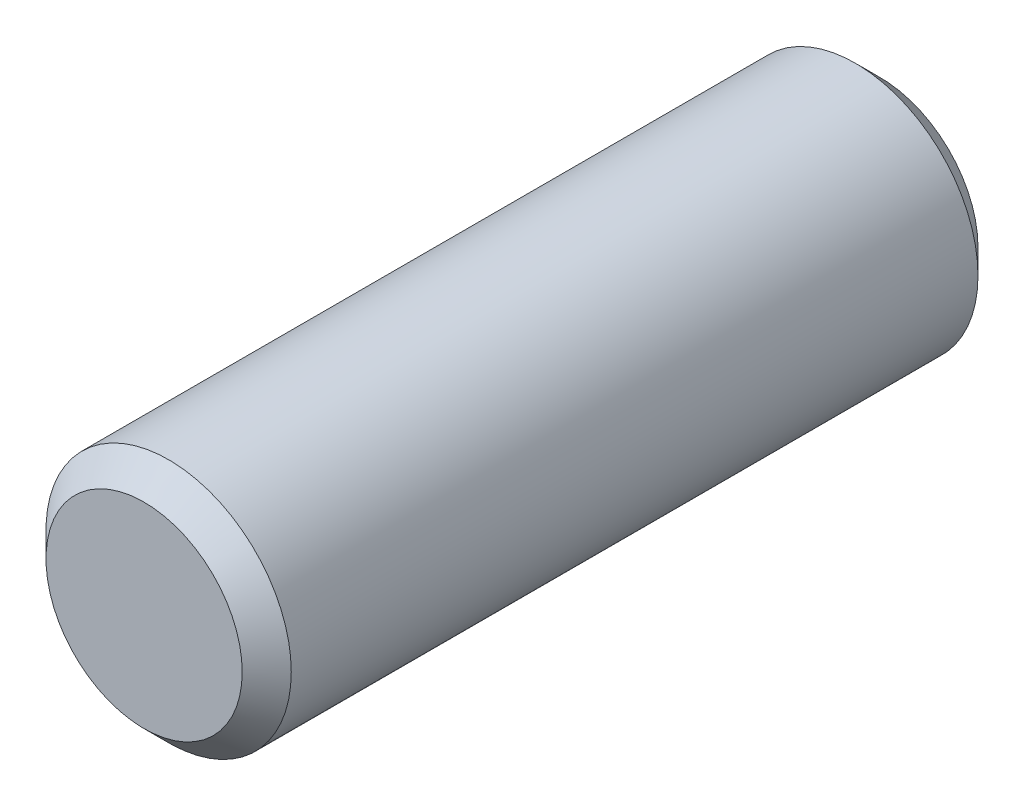
ISO-10303-21;
HEADER;
FILE_DESCRIPTION(('STEP AP214'),'2;1');
FILE_NAME('part.step','',(''),(''),'','','');
FILE_SCHEMA(('AUTOMOTIVE_DESIGN { 1 0 10303 214 1 1 1 1 }'));
ENDSEC;
DATA;
#1=APPLICATION_CONTEXT('core data for automotive mechanical design processes');
#2=APPLICATION_PROTOCOL_DEFINITION('international standard','automotive_design',2000,#1);
#3=PRODUCT_CONTEXT('',#1,'mechanical');
#4=PRODUCT('Part','Part','',(#3));
#5=PRODUCT_RELATED_PRODUCT_CATEGORY('part','',(#4));
#6=PRODUCT_DEFINITION_FORMATION('','',#4);
#7=PRODUCT_DEFINITION_CONTEXT('part definition',#1,'design');
#8=PRODUCT_DEFINITION('design','',#6,#7);
#9=PRODUCT_DEFINITION_SHAPE('','',#8);
#10=(LENGTH_UNIT() NAMED_UNIT(*) SI_UNIT(.MILLI.,.METRE.));
#11=(NAMED_UNIT(*) PLANE_ANGLE_UNIT() SI_UNIT($,.RADIAN.));
#12=(NAMED_UNIT(*) SI_UNIT($,.STERADIAN.) SOLID_ANGLE_UNIT());
#13=UNCERTAINTY_MEASURE_WITH_UNIT(LENGTH_MEASURE(1.E-05),#10,'distance_accuracy_value','');
#14=(GEOMETRIC_REPRESENTATION_CONTEXT(3) GLOBAL_UNCERTAINTY_ASSIGNED_CONTEXT((#13)) GLOBAL_UNIT_ASSIGNED_CONTEXT((#10,
#11,#12)) REPRESENTATION_CONTEXT('',''));
#15=CARTESIAN_POINT('',(0.,0.,0.));
#16=DIRECTION('',(0.,0.,1.));
#17=DIRECTION('',(1.,0.,0.));
#18=AXIS2_PLACEMENT_3D('',#15,#16,#17);
#19=CARTESIAN_POINT('',(0.,0.,3.));
#20=DIRECTION('',(0.,0.,-1.));
#21=DIRECTION('',(-1.,0.,0.));
#22=AXIS2_PLACEMENT_3D('',#19,#20,#21);
#23=CYLINDRICAL_SURFACE('',#22,1.);
#24=CARTESIAN_POINT('',(0.,0.,-2.8));
#25=DIRECTION('',(0.,0.,1.));
#26=DIRECTION('',(1.,0.,0.));
#27=AXIS2_PLACEMENT_3D('',#24,#25,#26);
#28=CIRCLE('',#27,1.);
#29=CARTESIAN_POINT('',(1.,0.,-2.8));
#30=VERTEX_POINT('',#29);
#31=EDGE_CURVE('E45',#30,#30,#28,.T.);
#32=ORIENTED_EDGE('',*,*,#31,.T.);
#33=EDGE_LOOP('',(#32));
#34=FACE_BOUND('',#33,.T.);
#35=CARTESIAN_POINT('',(0.,0.,2.8));
#36=DIRECTION('',(0.,0.,1.));
#37=DIRECTION('',(1.,0.,0.));
#38=AXIS2_PLACEMENT_3D('',#35,#36,#37);
#39=CIRCLE('',#38,1.);
#40=CARTESIAN_POINT('',(1.,0.,2.8));
#41=VERTEX_POINT('',#40);
#42=EDGE_CURVE('E49',#41,#41,#39,.F.);
#43=ORIENTED_EDGE('',*,*,#42,.T.);
#44=EDGE_LOOP('',(#43));
#45=FACE_BOUND('',#44,.T.);
#46=ADVANCED_FACE('F33',(#34,#45),#23,.T.);
#47=CARTESIAN_POINT('',(0.,0.,3.));
#48=DIRECTION('',(0.,0.,1.));
#49=DIRECTION('',(1.,0.,0.));
#50=AXIS2_PLACEMENT_3D('',#47,#48,#49);
#51=PLANE('',#50);
#52=CARTESIAN_POINT('',(0.,0.,3.));
#53=DIRECTION('',(0.,0.,1.));
#54=DIRECTION('',(1.,0.,0.));
#55=AXIS2_PLACEMENT_3D('',#52,#53,#54);
#56=CIRCLE('',#55,0.8);
#57=CARTESIAN_POINT('',(0.8,0.,3.));
#58=VERTEX_POINT('',#57);
#59=EDGE_CURVE('E10',#58,#58,#56,.T.);
#60=ORIENTED_EDGE('',*,*,#59,.T.);
#61=EDGE_LOOP('',(#60));
#62=FACE_BOUND('',#61,.T.);
#63=ADVANCED_FACE('F65',(#62),#51,.T.);
#64=CARTESIAN_POINT('',(0.,0.,-3.));
#65=DIRECTION('',(0.,0.,1.));
#66=DIRECTION('',(1.,0.,0.));
#67=AXIS2_PLACEMENT_3D('',#64,#65,#66);
#68=PLANE('',#67);
#69=CARTESIAN_POINT('',(0.,0.,-3.));
#70=DIRECTION('',(0.,0.,1.));
#71=DIRECTION('',(1.,0.,0.));
#72=AXIS2_PLACEMENT_3D('',#69,#70,#71);
#73=CIRCLE('',#72,0.799999999999999);
#74=CARTESIAN_POINT('',(0.799999999999999,0.,-3.));
#75=VERTEX_POINT('',#74);
#76=EDGE_CURVE('E41',#75,#75,#73,.F.);
#77=ORIENTED_EDGE('',*,*,#76,.T.);
#78=EDGE_LOOP('',(#77));
#79=FACE_BOUND('',#78,.T.);
#80=ADVANCED_FACE('F62',(#79),#68,.F.);
#81=CARTESIAN_POINT('',(0.,0.,-2.8));
#82=DIRECTION('',(0.,0.,1.));
#83=DIRECTION('',(1.,0.,0.));
#84=AXIS2_PLACEMENT_3D('',#81,#82,#83);
#85=CONICAL_SURFACE('',#84,1.,0.78539816339745);
#86=ORIENTED_EDGE('',*,*,#76,.F.);
#87=EDGE_LOOP('',(#86));
#88=FACE_BOUND('',#87,.T.);
#89=ORIENTED_EDGE('',*,*,#31,.F.);
#90=EDGE_LOOP('',(#89));
#91=FACE_BOUND('',#90,.T.);
#92=ADVANCED_FACE('F58',(#88,#91),#85,.T.);
#93=CARTESIAN_POINT('',(0.,0.,3.));
#94=DIRECTION('',(0.,0.,-1.));
#95=DIRECTION('',(-1.,0.,0.));
#96=AXIS2_PLACEMENT_3D('',#93,#94,#95);
#97=CONICAL_SURFACE('',#96,0.8,0.785398163397447);
#98=ORIENTED_EDGE('',*,*,#42,.F.);
#99=EDGE_LOOP('',(#98));
#100=FACE_BOUND('',#99,.T.);
#101=ORIENTED_EDGE('',*,*,#59,.F.);
#102=EDGE_LOOP('',(#101));
#103=FACE_BOUND('',#102,.T.);
#104=ADVANCED_FACE('F36',(#100,#103),#97,.T.);
#105=CLOSED_SHELL('',(#46,#63,#80,#92,#104));
#106=MANIFOLD_SOLID_BREP('B2',#105);
#107=ADVANCED_BREP_SHAPE_REPRESENTATION('',(#18,#106),#14);
#108=SHAPE_DEFINITION_REPRESENTATION(#9,#107);
ENDSEC;
END-ISO-10303-21;
